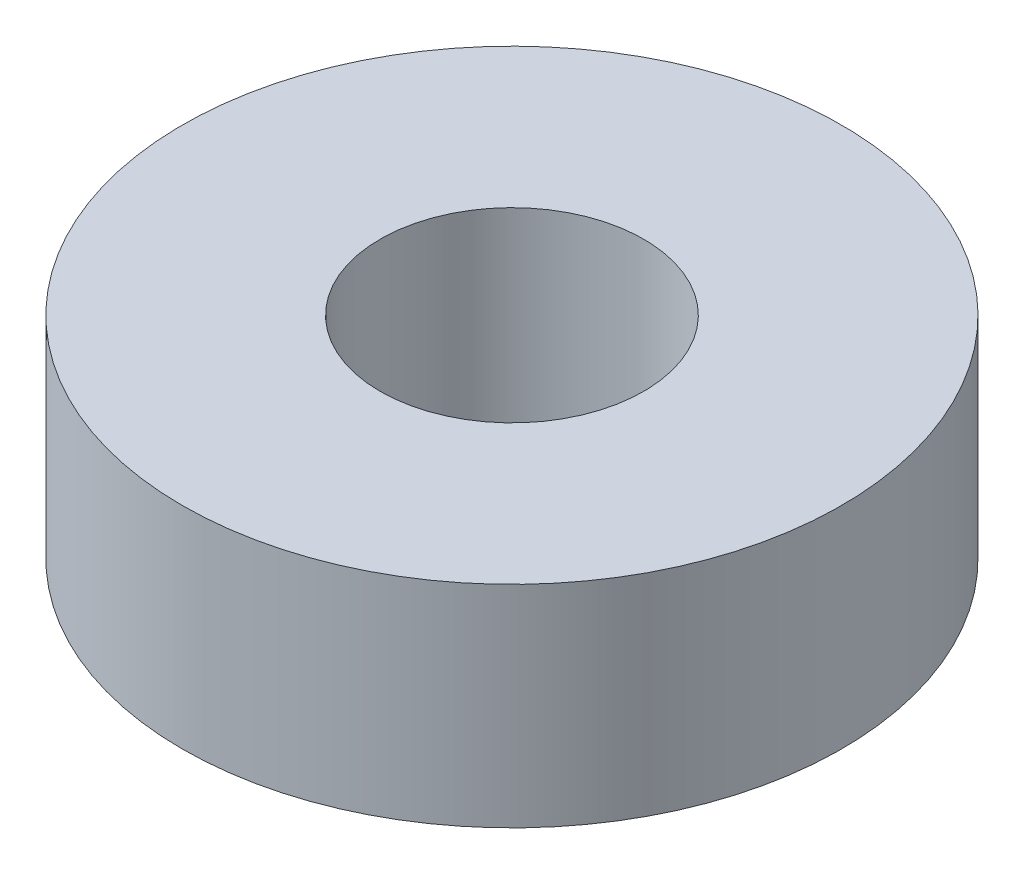
ISO-10303-21;
HEADER;
FILE_DESCRIPTION(('STEP AP214'),'2;1');
FILE_NAME('part.step','',(''),(''),'','','');
FILE_SCHEMA(('AUTOMOTIVE_DESIGN { 1 0 10303 214 1 1 1 1 }'));
ENDSEC;
DATA;
#1=APPLICATION_CONTEXT('core data for automotive mechanical design processes');
#2=APPLICATION_PROTOCOL_DEFINITION('international standard','automotive_design',2000,#1);
#3=PRODUCT_CONTEXT('',#1,'mechanical');
#4=PRODUCT('Part','Part','',(#3));
#5=PRODUCT_RELATED_PRODUCT_CATEGORY('part','',(#4));
#6=PRODUCT_DEFINITION_FORMATION('','',#4);
#7=PRODUCT_DEFINITION_CONTEXT('part definition',#1,'design');
#8=PRODUCT_DEFINITION('design','',#6,#7);
#9=PRODUCT_DEFINITION_SHAPE('','',#8);
#10=(LENGTH_UNIT() NAMED_UNIT(*) SI_UNIT(.MILLI.,.METRE.));
#11=(NAMED_UNIT(*) PLANE_ANGLE_UNIT() SI_UNIT($,.RADIAN.));
#12=(NAMED_UNIT(*) SI_UNIT($,.STERADIAN.) SOLID_ANGLE_UNIT());
#13=UNCERTAINTY_MEASURE_WITH_UNIT(LENGTH_MEASURE(1.E-05),#10,'distance_accuracy_value','');
#14=(GEOMETRIC_REPRESENTATION_CONTEXT(3) GLOBAL_UNCERTAINTY_ASSIGNED_CONTEXT((#13)) GLOBAL_UNIT_ASSIGNED_CONTEXT((#10,
#11,#12)) REPRESENTATION_CONTEXT('',''));
#15=CARTESIAN_POINT('',(0.,0.,0.));
#16=DIRECTION('',(0.,0.,1.));
#17=DIRECTION('',(1.,0.,0.));
#18=AXIS2_PLACEMENT_3D('',#15,#16,#17);
#19=CARTESIAN_POINT('',(0.,16.,0.));
#20=DIRECTION('',(0.,-1.,0.));
#21=DIRECTION('',(0.,0.,-1.));
#22=AXIS2_PLACEMENT_3D('',#19,#20,#21);
#23=CYLINDRICAL_SURFACE('',#22,25.);
#24=CARTESIAN_POINT('',(0.,16.,0.));
#25=DIRECTION('',(0.,1.,0.));
#26=DIRECTION('',(0.,0.,1.));
#27=AXIS2_PLACEMENT_3D('',#24,#25,#26);
#28=CIRCLE('',#27,25.);
#29=CARTESIAN_POINT('',(0.,16.,25.));
#30=VERTEX_POINT('',#29);
#31=EDGE_CURVE('E10',#30,#30,#28,.T.);
#32=ORIENTED_EDGE('',*,*,#31,.F.);
#33=EDGE_LOOP('',(#32));
#34=FACE_BOUND('',#33,.T.);
#35=CARTESIAN_POINT('',(0.,0.,0.));
#36=DIRECTION('',(0.,1.,0.));
#37=DIRECTION('',(0.,0.,1.));
#38=AXIS2_PLACEMENT_3D('',#35,#36,#37);
#39=CIRCLE('',#38,25.);
#40=CARTESIAN_POINT('',(0.,0.,25.));
#41=VERTEX_POINT('',#40);
#42=EDGE_CURVE('E37',#41,#41,#39,.T.);
#43=ORIENTED_EDGE('',*,*,#42,.T.);
#44=EDGE_LOOP('',(#43));
#45=FACE_BOUND('',#44,.T.);
#46=ADVANCED_FACE('F40',(#34,#45),#23,.T.);
#47=CARTESIAN_POINT('',(0.,16.,0.));
#48=DIRECTION('',(0.,1.,0.));
#49=DIRECTION('',(0.,0.,1.));
#50=AXIS2_PLACEMENT_3D('',#47,#48,#49);
#51=PLANE('',#50);
#52=CARTESIAN_POINT('',(0.,16.,0.));
#53=DIRECTION('',(0.,1.,0.));
#54=DIRECTION('',(0.,0.,1.));
#55=AXIS2_PLACEMENT_3D('',#52,#53,#54);
#56=CIRCLE('',#55,10.);
#57=CARTESIAN_POINT('',(0.,16.,10.));
#58=VERTEX_POINT('',#57);
#59=EDGE_CURVE('E50',#58,#58,#56,.T.);
#60=ORIENTED_EDGE('',*,*,#59,.F.);
#61=EDGE_LOOP('',(#60));
#62=FACE_BOUND('',#61,.T.);
#63=ORIENTED_EDGE('',*,*,#31,.T.);
#64=EDGE_LOOP('',(#63));
#65=FACE_BOUND('',#64,.T.);
#66=ADVANCED_FACE('F59',(#62,#65),#51,.T.);
#67=CARTESIAN_POINT('',(0.,0.,0.));
#68=DIRECTION('',(0.,1.,0.));
#69=DIRECTION('',(0.,0.,1.));
#70=AXIS2_PLACEMENT_3D('',#67,#68,#69);
#71=PLANE('',#70);
#72=CARTESIAN_POINT('',(0.,0.,0.));
#73=DIRECTION('',(0.,1.,0.));
#74=DIRECTION('',(0.,0.,1.));
#75=AXIS2_PLACEMENT_3D('',#72,#73,#74);
#76=CIRCLE('',#75,10.);
#77=CARTESIAN_POINT('',(0.,0.,10.));
#78=VERTEX_POINT('',#77);
#79=EDGE_CURVE('E47',#78,#78,#76,.T.);
#80=ORIENTED_EDGE('',*,*,#79,.T.);
#81=EDGE_LOOP('',(#80));
#82=FACE_BOUND('',#81,.T.);
#83=ORIENTED_EDGE('',*,*,#42,.F.);
#84=EDGE_LOOP('',(#83));
#85=FACE_BOUND('',#84,.T.);
#86=ADVANCED_FACE('F58',(#82,#85),#71,.F.);
#87=CARTESIAN_POINT('',(0.,16.,0.));
#88=DIRECTION('',(0.,-1.,0.));
#89=DIRECTION('',(0.,0.,-1.));
#90=AXIS2_PLACEMENT_3D('',#87,#88,#89);
#91=CYLINDRICAL_SURFACE('',#90,10.);
#92=ORIENTED_EDGE('',*,*,#59,.T.);
#93=EDGE_LOOP('',(#92));
#94=FACE_BOUND('',#93,.T.);
#95=ORIENTED_EDGE('',*,*,#79,.F.);
#96=EDGE_LOOP('',(#95));
#97=FACE_BOUND('',#96,.T.);
#98=ADVANCED_FACE('F54',(#94,#97),#91,.F.);
#99=CLOSED_SHELL('',(#46,#66,#86,#98));
#100=MANIFOLD_SOLID_BREP('B2',#99);
#101=ADVANCED_BREP_SHAPE_REPRESENTATION('',(#18,#100),#14);
#102=SHAPE_DEFINITION_REPRESENTATION(#9,#101);
ENDSEC;
END-ISO-10303-21;
